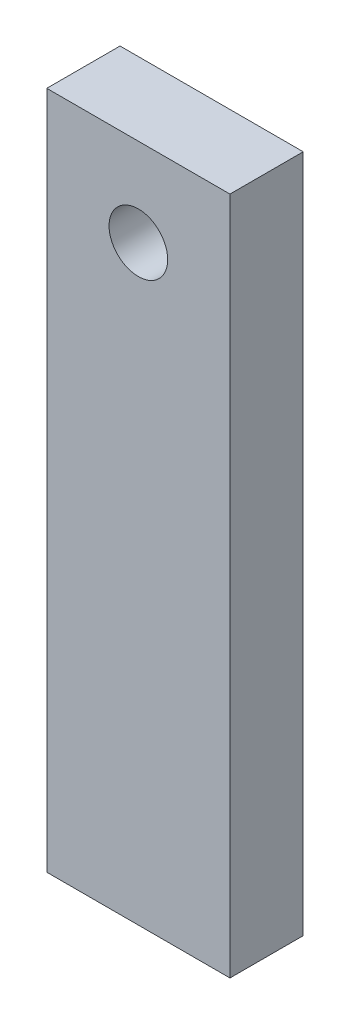
ISO-10303-21;
HEADER;
FILE_DESCRIPTION(('STEP AP214'),'2;1');
FILE_NAME('part.step','',(''),(''),'','','');
FILE_SCHEMA(('AUTOMOTIVE_DESIGN { 1 0 10303 214 1 1 1 1 }'));
ENDSEC;
DATA;
#1=APPLICATION_CONTEXT('core data for automotive mechanical design processes');
#2=APPLICATION_PROTOCOL_DEFINITION('international standard','automotive_design',2000,#1);
#3=PRODUCT_CONTEXT('',#1,'mechanical');
#4=PRODUCT('Part','Part','',(#3));
#5=PRODUCT_RELATED_PRODUCT_CATEGORY('part','',(#4));
#6=PRODUCT_DEFINITION_FORMATION('','',#4);
#7=PRODUCT_DEFINITION_CONTEXT('part definition',#1,'design');
#8=PRODUCT_DEFINITION('design','',#6,#7);
#9=PRODUCT_DEFINITION_SHAPE('','',#8);
#10=(LENGTH_UNIT() NAMED_UNIT(*) SI_UNIT(.MILLI.,.METRE.));
#11=(NAMED_UNIT(*) PLANE_ANGLE_UNIT() SI_UNIT($,.RADIAN.));
#12=(NAMED_UNIT(*) SI_UNIT($,.STERADIAN.) SOLID_ANGLE_UNIT());
#13=UNCERTAINTY_MEASURE_WITH_UNIT(LENGTH_MEASURE(1.E-05),#10,'distance_accuracy_value','');
#14=(GEOMETRIC_REPRESENTATION_CONTEXT(3) GLOBAL_UNCERTAINTY_ASSIGNED_CONTEXT((#13)) GLOBAL_UNIT_ASSIGNED_CONTEXT((#10,
#11,#12)) REPRESENTATION_CONTEXT('',''));
#15=CARTESIAN_POINT('',(0.,0.,0.));
#16=DIRECTION('',(0.,0.,1.));
#17=DIRECTION('',(1.,0.,0.));
#18=AXIS2_PLACEMENT_3D('',#15,#16,#17);
#19=CARTESIAN_POINT('',(0.,0.,10.));
#20=DIRECTION('',(0.,0.,1.));
#21=DIRECTION('',(1.,0.,0.));
#22=AXIS2_PLACEMENT_3D('',#19,#20,#21);
#23=PLANE('',#22);
#24=DIRECTION('',(0.,1.,0.));
#25=VECTOR('',#24,1.);
#26=CARTESIAN_POINT('',(12.5,46.3293,10.));
#27=LINE('',#26,#25);
#28=CARTESIAN_POINT('',(12.5,-46.3293,10.));
#29=VERTEX_POINT('',#28);
#30=CARTESIAN_POINT('',(12.5,46.3293,10.));
#31=VERTEX_POINT('',#30);
#32=EDGE_CURVE('E85',#29,#31,#27,.T.);
#33=ORIENTED_EDGE('',*,*,#32,.T.);
#34=DIRECTION('',(-1.,0.,0.));
#35=VECTOR('',#34,1.);
#36=CARTESIAN_POINT('',(-12.5,46.3293,10.));
#37=LINE('',#36,#35);
#38=CARTESIAN_POINT('',(-12.5,46.3293,10.));
#39=VERTEX_POINT('',#38);
#40=EDGE_CURVE('E80',#31,#39,#37,.T.);
#41=ORIENTED_EDGE('',*,*,#40,.T.);
#42=DIRECTION('',(0.,-1.,0.));
#43=VECTOR('',#42,1.);
#44=CARTESIAN_POINT('',(-12.5,46.3293,10.));
#45=LINE('',#44,#43);
#46=CARTESIAN_POINT('',(-12.5,-46.3293,10.));
#47=VERTEX_POINT('',#46);
#48=EDGE_CURVE('E83',#39,#47,#45,.T.);
#49=ORIENTED_EDGE('',*,*,#48,.T.);
#50=DIRECTION('',(1.,0.,0.));
#51=VECTOR('',#50,1.);
#52=CARTESIAN_POINT('',(-12.5,-46.3293,10.));
#53=LINE('',#52,#51);
#54=EDGE_CURVE('E50',#47,#29,#53,.T.);
#55=ORIENTED_EDGE('',*,*,#54,.T.);
#56=EDGE_LOOP('',(#33,#41,#49,#55));
#57=FACE_BOUND('',#56,.T.);
#58=CARTESIAN_POINT('',(0.,34.3293,10.));
#59=DIRECTION('',(0.,0.,1.));
#60=DIRECTION('',(1.,0.,0.));
#61=AXIS2_PLACEMENT_3D('',#58,#59,#60);
#62=CIRCLE('',#61,4.);
#63=CARTESIAN_POINT('',(4.,34.3293,10.));
#64=VERTEX_POINT('',#63);
#65=EDGE_CURVE('E100',#64,#64,#62,.T.);
#66=ORIENTED_EDGE('',*,*,#65,.F.);
#67=EDGE_LOOP('',(#66));
#68=FACE_BOUND('',#67,.T.);
#69=ADVANCED_FACE('F33',(#57,#68),#23,.T.);
#70=CARTESIAN_POINT('',(0.,0.,0.));
#71=DIRECTION('',(0.,0.,1.));
#72=DIRECTION('',(1.,0.,0.));
#73=AXIS2_PLACEMENT_3D('',#70,#71,#72);
#74=PLANE('',#73);
#75=DIRECTION('',(0.,1.,0.));
#76=VECTOR('',#75,1.);
#77=CARTESIAN_POINT('',(12.5,46.3293,0.));
#78=LINE('',#77,#76);
#79=CARTESIAN_POINT('',(12.5,-46.3293,0.));
#80=VERTEX_POINT('',#79);
#81=CARTESIAN_POINT('',(12.5,46.3293,0.));
#82=VERTEX_POINT('',#81);
#83=EDGE_CURVE('E97',#80,#82,#78,.T.);
#84=ORIENTED_EDGE('',*,*,#83,.F.);
#85=DIRECTION('',(1.,0.,0.));
#86=VECTOR('',#85,1.);
#87=CARTESIAN_POINT('',(-12.5,-46.3293,0.));
#88=LINE('',#87,#86);
#89=CARTESIAN_POINT('',(-12.5,-46.3293,0.));
#90=VERTEX_POINT('',#89);
#91=EDGE_CURVE('E73',#90,#80,#88,.T.);
#92=ORIENTED_EDGE('',*,*,#91,.F.);
#93=DIRECTION('',(0.,-1.,0.));
#94=VECTOR('',#93,1.);
#95=CARTESIAN_POINT('',(-12.5,46.3293,0.));
#96=LINE('',#95,#94);
#97=CARTESIAN_POINT('',(-12.5,46.3293,0.));
#98=VERTEX_POINT('',#97);
#99=EDGE_CURVE('E67',#98,#90,#96,.T.);
#100=ORIENTED_EDGE('',*,*,#99,.F.);
#101=DIRECTION('',(-1.,0.,0.));
#102=VECTOR('',#101,1.);
#103=CARTESIAN_POINT('',(-12.5,46.3293,0.));
#104=LINE('',#103,#102);
#105=EDGE_CURVE('E89',#82,#98,#104,.T.);
#106=ORIENTED_EDGE('',*,*,#105,.F.);
#107=EDGE_LOOP('',(#84,#92,#100,#106));
#108=FACE_BOUND('',#107,.T.);
#109=CARTESIAN_POINT('',(0.,34.3293,0.));
#110=DIRECTION('',(0.,0.,1.));
#111=DIRECTION('',(1.,0.,0.));
#112=AXIS2_PLACEMENT_3D('',#109,#110,#111);
#113=CIRCLE('',#112,4.);
#114=CARTESIAN_POINT('',(4.,34.3293,0.));
#115=VERTEX_POINT('',#114);
#116=EDGE_CURVE('E112',#115,#115,#113,.T.);
#117=ORIENTED_EDGE('',*,*,#116,.T.);
#118=EDGE_LOOP('',(#117));
#119=FACE_BOUND('',#118,.T.);
#120=ADVANCED_FACE('F108',(#108,#119),#74,.F.);
#121=CARTESIAN_POINT('',(12.5,46.3293,10.));
#122=DIRECTION('',(-1.,0.,0.));
#123=DIRECTION('',(0.,0.,1.));
#124=AXIS2_PLACEMENT_3D('',#121,#122,#123);
#125=PLANE('',#124);
#126=ORIENTED_EDGE('',*,*,#83,.T.);
#127=DIRECTION('',(0.,0.,-1.));
#128=VECTOR('',#127,1.);
#129=CARTESIAN_POINT('',(12.5,46.3293,10.));
#130=LINE('',#129,#128);
#131=EDGE_CURVE('E11',#31,#82,#130,.T.);
#132=ORIENTED_EDGE('',*,*,#131,.F.);
#133=ORIENTED_EDGE('',*,*,#32,.F.);
#134=DIRECTION('',(0.,0.,-1.));
#135=VECTOR('',#134,1.);
#136=CARTESIAN_POINT('',(12.5,-46.3293,10.));
#137=LINE('',#136,#135);
#138=EDGE_CURVE('E93',#29,#80,#137,.T.);
#139=ORIENTED_EDGE('',*,*,#138,.T.);
#140=EDGE_LOOP('',(#126,#132,#133,#139));
#141=FACE_BOUND('',#140,.T.);
#142=ADVANCED_FACE('F35',(#141),#125,.F.);
#143=CARTESIAN_POINT('',(-12.5,46.3293,10.));
#144=DIRECTION('',(0.,-1.,0.));
#145=DIRECTION('',(0.,0.,-1.));
#146=AXIS2_PLACEMENT_3D('',#143,#144,#145);
#147=PLANE('',#146);
#148=ORIENTED_EDGE('',*,*,#105,.T.);
#149=DIRECTION('',(0.,0.,-1.));
#150=VECTOR('',#149,1.);
#151=CARTESIAN_POINT('',(-12.5,46.3293,10.));
#152=LINE('',#151,#150);
#153=EDGE_CURVE('E42',#39,#98,#152,.T.);
#154=ORIENTED_EDGE('',*,*,#153,.F.);
#155=ORIENTED_EDGE('',*,*,#40,.F.);
#156=ORIENTED_EDGE('',*,*,#131,.T.);
#157=EDGE_LOOP('',(#148,#154,#155,#156));
#158=FACE_BOUND('',#157,.T.);
#159=ADVANCED_FACE('F88',(#158),#147,.F.);
#160=CARTESIAN_POINT('',(-12.5,46.3293,10.));
#161=DIRECTION('',(1.,0.,0.));
#162=DIRECTION('',(0.,1.,0.));
#163=AXIS2_PLACEMENT_3D('',#160,#161,#162);
#164=PLANE('',#163);
#165=ORIENTED_EDGE('',*,*,#99,.T.);
#166=DIRECTION('',(0.,0.,-1.));
#167=VECTOR('',#166,1.);
#168=CARTESIAN_POINT('',(-12.5,-46.3293,10.));
#169=LINE('',#168,#167);
#170=EDGE_CURVE('E90',#47,#90,#169,.T.);
#171=ORIENTED_EDGE('',*,*,#170,.F.);
#172=ORIENTED_EDGE('',*,*,#48,.F.);
#173=ORIENTED_EDGE('',*,*,#153,.T.);
#174=EDGE_LOOP('',(#165,#171,#172,#173));
#175=FACE_BOUND('',#174,.T.);
#176=ADVANCED_FACE('F91',(#175),#164,.F.);
#177=CARTESIAN_POINT('',(-12.5,-46.3293,10.));
#178=DIRECTION('',(0.,1.,0.));
#179=DIRECTION('',(0.,0.,1.));
#180=AXIS2_PLACEMENT_3D('',#177,#178,#179);
#181=PLANE('',#180);
#182=ORIENTED_EDGE('',*,*,#91,.T.);
#183=ORIENTED_EDGE('',*,*,#138,.F.);
#184=ORIENTED_EDGE('',*,*,#54,.F.);
#185=ORIENTED_EDGE('',*,*,#170,.T.);
#186=EDGE_LOOP('',(#182,#183,#184,#185));
#187=FACE_BOUND('',#186,.T.);
#188=ADVANCED_FACE('F105',(#187),#181,.F.);
#189=CARTESIAN_POINT('',(0.,34.3293,10.));
#190=DIRECTION('',(0.,0.,-1.));
#191=DIRECTION('',(-1.,0.,0.));
#192=AXIS2_PLACEMENT_3D('',#189,#190,#191);
#193=CYLINDRICAL_SURFACE('',#192,4.);
#194=ORIENTED_EDGE('',*,*,#65,.T.);
#195=EDGE_LOOP('',(#194));
#196=FACE_BOUND('',#195,.T.);
#197=ORIENTED_EDGE('',*,*,#116,.F.);
#198=EDGE_LOOP('',(#197));
#199=FACE_BOUND('',#198,.T.);
#200=ADVANCED_FACE('F118',(#196,#199),#193,.F.);
#201=CLOSED_SHELL('',(#69,#120,#142,#159,#176,#188,#200));
#202=MANIFOLD_SOLID_BREP('B2',#201);
#203=ADVANCED_BREP_SHAPE_REPRESENTATION('',(#18,#202),#14);
#204=SHAPE_DEFINITION_REPRESENTATION(#9,#203);
ENDSEC;
END-ISO-10303-21;
